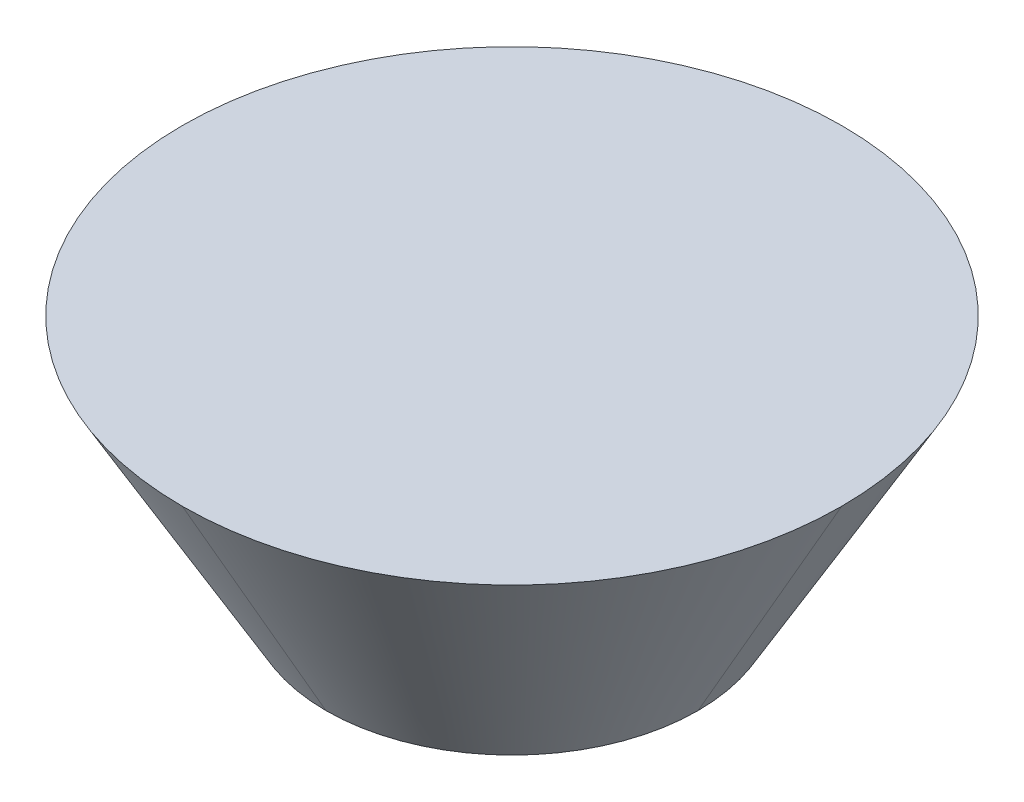
ISO-10303-21;
HEADER;
FILE_DESCRIPTION(('STEP AP214'),'2;1');
FILE_NAME('part.step','',(''),(''),'','','');
FILE_SCHEMA(('AUTOMOTIVE_DESIGN { 1 0 10303 214 1 1 1 1 }'));
ENDSEC;
DATA;
#1=APPLICATION_CONTEXT('core data for automotive mechanical design processes');
#2=APPLICATION_PROTOCOL_DEFINITION('international standard','automotive_design',2000,#1);
#3=PRODUCT_CONTEXT('',#1,'mechanical');
#4=PRODUCT('Part','Part','',(#3));
#5=PRODUCT_RELATED_PRODUCT_CATEGORY('part','',(#4));
#6=PRODUCT_DEFINITION_FORMATION('','',#4);
#7=PRODUCT_DEFINITION_CONTEXT('part definition',#1,'design');
#8=PRODUCT_DEFINITION('design','',#6,#7);
#9=PRODUCT_DEFINITION_SHAPE('','',#8);
#10=(LENGTH_UNIT() NAMED_UNIT(*) SI_UNIT(.MILLI.,.METRE.));
#11=(NAMED_UNIT(*) PLANE_ANGLE_UNIT() SI_UNIT($,.RADIAN.));
#12=(NAMED_UNIT(*) SI_UNIT($,.STERADIAN.) SOLID_ANGLE_UNIT());
#13=UNCERTAINTY_MEASURE_WITH_UNIT(LENGTH_MEASURE(1.E-05),#10,'distance_accuracy_value','');
#14=(GEOMETRIC_REPRESENTATION_CONTEXT(3) GLOBAL_UNCERTAINTY_ASSIGNED_CONTEXT((#13)) GLOBAL_UNIT_ASSIGNED_CONTEXT((#10,
#11,#12)) REPRESENTATION_CONTEXT('',''));
#15=CARTESIAN_POINT('',(0.,0.,0.));
#16=DIRECTION('',(0.,0.,1.));
#17=DIRECTION('',(1.,0.,0.));
#18=AXIS2_PLACEMENT_3D('',#15,#16,#17);
#19=CARTESIAN_POINT('',(0.,18.,0.));
#20=DIRECTION('',(0.,-1.,0.));
#21=DIRECTION('',(0.,0.,-1.));
#22=AXIS2_PLACEMENT_3D('',#19,#20,#21);
#23=PLANE('',#22);
#24=CARTESIAN_POINT('',(0.,18.,0.));
#25=DIRECTION('',(0.,-1.,0.));
#26=DIRECTION('',(0.,0.,-1.));
#27=AXIS2_PLACEMENT_3D('',#24,#25,#26);
#28=CIRCLE('',#27,23.8452994616207);
#29=CARTESIAN_POINT('',(-23.8452994616207,18.,0.));
#30=VERTEX_POINT('',#29);
#31=CARTESIAN_POINT('',(0.,18.,23.8452994616207));
#32=VERTEX_POINT('',#31);
#33=EDGE_CURVE('E110',#30,#32,#28,.F.);
#34=ORIENTED_EDGE('',*,*,#33,.T.);
#35=CARTESIAN_POINT('',(0.,18.,0.));
#36=DIRECTION('',(0.,-1.,0.));
#37=DIRECTION('',(0.,0.,-1.));
#38=AXIS2_PLACEMENT_3D('',#35,#36,#37);
#39=CIRCLE('',#38,23.8452994616207);
#40=CARTESIAN_POINT('',(23.8452994616207,18.,0.));
#41=VERTEX_POINT('',#40);
#42=EDGE_CURVE('E11',#32,#41,#39,.F.);
#43=ORIENTED_EDGE('',*,*,#42,.T.);
#44=CARTESIAN_POINT('',(0.,18.,0.));
#45=DIRECTION('',(0.,-1.,0.));
#46=DIRECTION('',(0.,0.,-1.));
#47=AXIS2_PLACEMENT_3D('',#44,#45,#46);
#48=CIRCLE('',#47,23.8452994616207);
#49=CARTESIAN_POINT('',(0.,18.,-23.8452994616207));
#50=VERTEX_POINT('',#49);
#51=EDGE_CURVE('E55',#41,#50,#48,.F.);
#52=ORIENTED_EDGE('',*,*,#51,.T.);
#53=CARTESIAN_POINT('',(0.,18.,0.));
#54=DIRECTION('',(0.,-1.,0.));
#55=DIRECTION('',(0.,0.,-1.));
#56=AXIS2_PLACEMENT_3D('',#53,#54,#55);
#57=CIRCLE('',#56,23.8452994616207);
#58=EDGE_CURVE('E114',#50,#30,#57,.F.);
#59=ORIENTED_EDGE('',*,*,#58,.T.);
#60=EDGE_LOOP('',(#34,#43,#52,#59));
#61=FACE_BOUND('',#60,.T.);
#62=ADVANCED_FACE('F44',(#61),#23,.F.);
#63=CARTESIAN_POINT('',(0.,0.,0.));
#64=DIRECTION('',(0.,-1.,0.));
#65=DIRECTION('',(0.,0.,-1.));
#66=AXIS2_PLACEMENT_3D('',#63,#64,#65);
#67=PLANE('',#66);
#68=CARTESIAN_POINT('',(0.,0.,0.));
#69=DIRECTION('',(0.,-1.,0.));
#70=DIRECTION('',(0.,0.,-1.));
#71=AXIS2_PLACEMENT_3D('',#68,#69,#70);
#72=CIRCLE('',#71,13.4529946162073);
#73=CARTESIAN_POINT('',(0.,0.,-13.4529946162073));
#74=VERTEX_POINT('',#73);
#75=CARTESIAN_POINT('',(13.4529946162073,0.,0.));
#76=VERTEX_POINT('',#75);
#77=EDGE_CURVE('E108',#74,#76,#72,.T.);
#78=ORIENTED_EDGE('',*,*,#77,.T.);
#79=CARTESIAN_POINT('',(0.,0.,0.));
#80=DIRECTION('',(0.,-1.,0.));
#81=DIRECTION('',(0.,0.,-1.));
#82=AXIS2_PLACEMENT_3D('',#79,#80,#81);
#83=CIRCLE('',#82,13.4529946162073);
#84=CARTESIAN_POINT('',(0.,0.,13.4529946162073));
#85=VERTEX_POINT('',#84);
#86=EDGE_CURVE('E91',#76,#85,#83,.T.);
#87=ORIENTED_EDGE('',*,*,#86,.T.);
#88=CARTESIAN_POINT('',(0.,0.,0.));
#89=DIRECTION('',(0.,-1.,0.));
#90=DIRECTION('',(0.,0.,-1.));
#91=AXIS2_PLACEMENT_3D('',#88,#89,#90);
#92=CIRCLE('',#91,13.4529946162073);
#93=CARTESIAN_POINT('',(-13.4529946162073,0.,0.));
#94=VERTEX_POINT('',#93);
#95=EDGE_CURVE('E97',#85,#94,#92,.T.);
#96=ORIENTED_EDGE('',*,*,#95,.T.);
#97=CARTESIAN_POINT('',(0.,0.,0.));
#98=DIRECTION('',(0.,-1.,0.));
#99=DIRECTION('',(0.,0.,-1.));
#100=AXIS2_PLACEMENT_3D('',#97,#98,#99);
#101=CIRCLE('',#100,13.4529946162073);
#102=EDGE_CURVE('E104',#94,#74,#101,.T.);
#103=ORIENTED_EDGE('',*,*,#102,.T.);
#104=EDGE_LOOP('',(#78,#87,#96,#103));
#105=FACE_BOUND('',#104,.T.);
#106=ADVANCED_FACE('F106',(#105),#67,.T.);
#107=CARTESIAN_POINT('',(0.,0.,0.));
#108=DIRECTION('',(0.,1.,0.));
#109=DIRECTION('',(0.,0.,1.));
#110=AXIS2_PLACEMENT_3D('',#107,#108,#109);
#111=CONICAL_SURFACE('',#110,13.4529946162073,0.523598775598305);
#112=DIRECTION('',(0.500000000000006,-0.866025403784435,0.));
#113=VECTOR('',#112,1.);
#114=CARTESIAN_POINT('',(-25.,20.0000000000001,0.));
#115=LINE('',#114,#113);
#116=EDGE_CURVE('E100',#30,#94,#115,.T.);
#117=ORIENTED_EDGE('',*,*,#116,.F.);
#118=ORIENTED_EDGE('',*,*,#58,.F.);
#119=DIRECTION('',(0.,0.866025403784435,-0.500000000000006));
#120=VECTOR('',#119,1.);
#121=CARTESIAN_POINT('',(0.,0.,-13.4529946162073));
#122=LINE('',#121,#120);
#123=EDGE_CURVE('E49',#74,#50,#122,.T.);
#124=ORIENTED_EDGE('',*,*,#123,.F.);
#125=ORIENTED_EDGE('',*,*,#102,.F.);
#126=EDGE_LOOP('',(#117,#118,#124,#125));
#127=FACE_BOUND('',#126,.T.);
#128=ADVANCED_FACE('F47',(#127),#111,.T.);
#129=CARTESIAN_POINT('',(0.,0.,0.));
#130=DIRECTION('',(0.,1.,0.));
#131=DIRECTION('',(0.,0.,1.));
#132=AXIS2_PLACEMENT_3D('',#129,#130,#131);
#133=CONICAL_SURFACE('',#132,13.4529946162073,0.523598775598305);
#134=ORIENTED_EDGE('',*,*,#123,.T.);
#135=ORIENTED_EDGE('',*,*,#51,.F.);
#136=DIRECTION('',(0.500000000000006,0.866025403784435,0.));
#137=VECTOR('',#136,1.);
#138=CARTESIAN_POINT('',(13.4529946162073,0.,0.));
#139=LINE('',#138,#137);
#140=EDGE_CURVE('E63',#76,#41,#139,.T.);
#141=ORIENTED_EDGE('',*,*,#140,.F.);
#142=ORIENTED_EDGE('',*,*,#77,.F.);
#143=EDGE_LOOP('',(#134,#135,#141,#142));
#144=FACE_BOUND('',#143,.T.);
#145=ADVANCED_FACE('F129',(#144),#133,.T.);
#146=CARTESIAN_POINT('',(0.,0.,0.));
#147=DIRECTION('',(0.,1.,0.));
#148=DIRECTION('',(0.,0.,1.));
#149=AXIS2_PLACEMENT_3D('',#146,#147,#148);
#150=CONICAL_SURFACE('',#149,13.4529946162073,0.523598775598305);
#151=ORIENTED_EDGE('',*,*,#116,.T.);
#152=ORIENTED_EDGE('',*,*,#95,.F.);
#153=DIRECTION('',(0.,-0.866025403784435,-0.500000000000006));
#154=VECTOR('',#153,1.);
#155=CARTESIAN_POINT('',(0.,20.0000000000001,25.));
#156=LINE('',#155,#154);
#157=EDGE_CURVE('E87',#32,#85,#156,.T.);
#158=ORIENTED_EDGE('',*,*,#157,.F.);
#159=ORIENTED_EDGE('',*,*,#33,.F.);
#160=EDGE_LOOP('',(#151,#152,#158,#159));
#161=FACE_BOUND('',#160,.T.);
#162=ADVANCED_FACE('F98',(#161),#150,.T.);
#163=CARTESIAN_POINT('',(0.,0.,0.));
#164=DIRECTION('',(0.,1.,0.));
#165=DIRECTION('',(0.,0.,1.));
#166=AXIS2_PLACEMENT_3D('',#163,#164,#165);
#167=CONICAL_SURFACE('',#166,13.4529946162073,0.523598775598305);
#168=ORIENTED_EDGE('',*,*,#86,.F.);
#169=ORIENTED_EDGE('',*,*,#140,.T.);
#170=ORIENTED_EDGE('',*,*,#42,.F.);
#171=ORIENTED_EDGE('',*,*,#157,.T.);
#172=EDGE_LOOP('',(#168,#169,#170,#171));
#173=FACE_BOUND('',#172,.T.);
#174=ADVANCED_FACE('F89',(#173),#167,.T.);
#175=CLOSED_SHELL('',(#62,#106,#128,#145,#162,#174));
#176=MANIFOLD_SOLID_BREP('B2',#175);
#177=ADVANCED_BREP_SHAPE_REPRESENTATION('',(#18,#176),#14);
#178=SHAPE_DEFINITION_REPRESENTATION(#9,#177);
ENDSEC;
END-ISO-10303-21;
